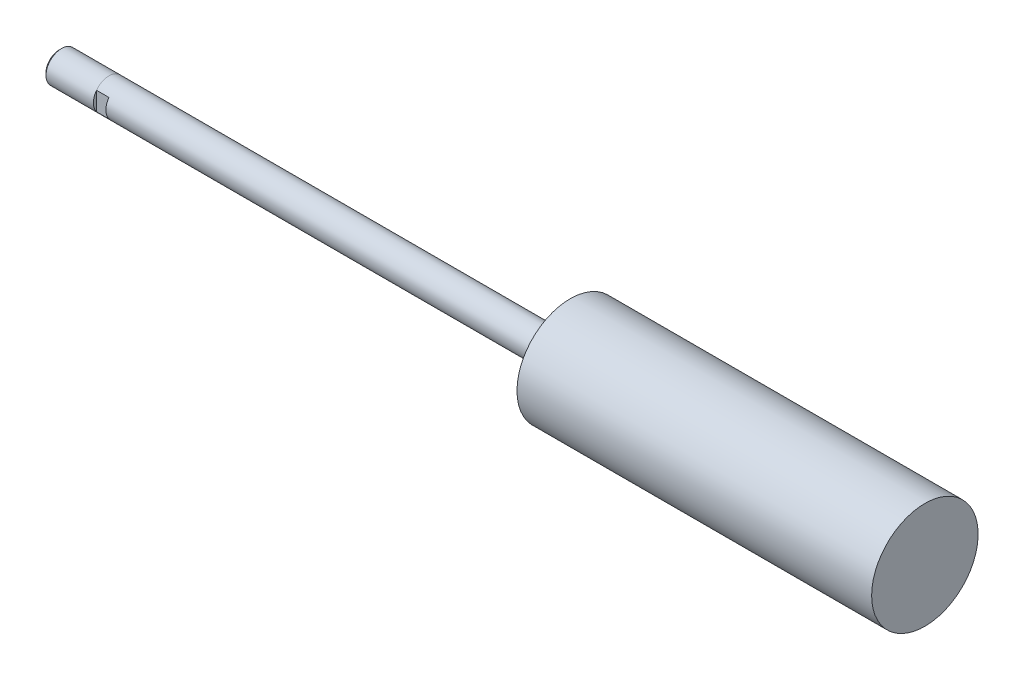
ISO-10303-21;
HEADER;
FILE_DESCRIPTION(('STEP AP214'),'2;1');
FILE_NAME('part.step','',(''),(''),'','','');
FILE_SCHEMA(('AUTOMOTIVE_DESIGN { 1 0 10303 214 1 1 1 1 }'));
ENDSEC;
DATA;
#1=APPLICATION_CONTEXT('core data for automotive mechanical design processes');
#2=APPLICATION_PROTOCOL_DEFINITION('international standard','automotive_design',2000,#1);
#3=PRODUCT_CONTEXT('',#1,'mechanical');
#4=PRODUCT('Part','Part','',(#3));
#5=PRODUCT_RELATED_PRODUCT_CATEGORY('part','',(#4));
#6=PRODUCT_DEFINITION_FORMATION('','',#4);
#7=PRODUCT_DEFINITION_CONTEXT('part definition',#1,'design');
#8=PRODUCT_DEFINITION('design','',#6,#7);
#9=PRODUCT_DEFINITION_SHAPE('','',#8);
#10=(LENGTH_UNIT() NAMED_UNIT(*) SI_UNIT(.MILLI.,.METRE.));
#11=(NAMED_UNIT(*) PLANE_ANGLE_UNIT() SI_UNIT($,.RADIAN.));
#12=(NAMED_UNIT(*) SI_UNIT($,.STERADIAN.) SOLID_ANGLE_UNIT());
#13=UNCERTAINTY_MEASURE_WITH_UNIT(LENGTH_MEASURE(1.E-05),#10,'distance_accuracy_value','');
#14=(GEOMETRIC_REPRESENTATION_CONTEXT(3) GLOBAL_UNCERTAINTY_ASSIGNED_CONTEXT((#13)) GLOBAL_UNIT_ASSIGNED_CONTEXT((#10,
#11,#12)) REPRESENTATION_CONTEXT('',''));
#15=CARTESIAN_POINT('',(0.,0.,0.));
#16=DIRECTION('',(0.,0.,1.));
#17=DIRECTION('',(1.,0.,0.));
#18=AXIS2_PLACEMENT_3D('',#15,#16,#17);
#19=CARTESIAN_POINT('',(204.6224,0.,0.));
#20=DIRECTION('',(-1.,0.,0.));
#21=DIRECTION('',(0.,0.,1.));
#22=AXIS2_PLACEMENT_3D('',#19,#20,#21);
#23=CYLINDRICAL_SURFACE('',#22,3.9624);
#24=DIRECTION('',(-1.,0.,0.));
#25=VECTOR('',#24,1.);
#26=CARTESIAN_POINT('',(204.6224,2.37065154757084,-3.175));
#27=LINE('',#26,#25);
#28=CARTESIAN_POINT('',(0.,2.37065154757084,-3.175));
#29=VERTEX_POINT('',#28);
#30=CARTESIAN_POINT('',(-3.175,2.37595077378542,-3.175));
#31=VERTEX_POINT('',#30);
#32=EDGE_CURVE('E100',#29,#31,#27,.T.);
#33=ORIENTED_EDGE('',*,*,#32,.T.);
#34=CARTESIAN_POINT('',(-3.175,0.,0.));
#35=DIRECTION('',(-1.,0.,0.));
#36=DIRECTION('',(0.,0.599143734238293,0.800641483888384));
#37=AXIS2_PLACEMENT_3D('',#34,#35,#36);
#38=CIRCLE('',#37,3.96875);
#39=CARTESIAN_POINT('',(-3.17500000000001,2.37594941390202,3.17500385247068));
#40=VERTEX_POINT('',#39);
#41=EDGE_CURVE('E80',#40,#31,#38,.T.);
#42=ORIENTED_EDGE('',*,*,#41,.F.);
#43=DIRECTION('',(-1.,0.,0.));
#44=VECTOR('',#43,1.);
#45=CARTESIAN_POINT('',(204.6224,2.37065154757084,3.175));
#46=LINE('',#45,#44);
#47=CARTESIAN_POINT('',(0.,2.37065154757084,3.175));
#48=VERTEX_POINT('',#47);
#49=EDGE_CURVE('E109',#40,#48,#46,.F.);
#50=ORIENTED_EDGE('',*,*,#49,.T.);
#51=CARTESIAN_POINT('',(0.,0.,0.));
#52=DIRECTION('',(1.,0.,0.));
#53=DIRECTION('',(0.,0.,-1.));
#54=AXIS2_PLACEMENT_3D('',#51,#52,#53);
#55=CIRCLE('',#54,3.9624);
#56=CARTESIAN_POINT('',(0.,-2.37065154757084,3.175));
#57=VERTEX_POINT('',#56);
#58=EDGE_CURVE('E11',#48,#57,#55,.T.);
#59=ORIENTED_EDGE('',*,*,#58,.T.);
#60=DIRECTION('',(-1.,0.,0.));
#61=VECTOR('',#60,1.);
#62=CARTESIAN_POINT('',(204.6224,-2.37065154757084,3.175));
#63=LINE('',#62,#61);
#64=CARTESIAN_POINT('',(-3.175,-2.37595077378542,3.175));
#65=VERTEX_POINT('',#64);
#66=EDGE_CURVE('E111',#57,#65,#63,.T.);
#67=ORIENTED_EDGE('',*,*,#66,.T.);
#68=CARTESIAN_POINT('',(-3.175,0.,0.));
#69=DIRECTION('',(-1.,0.,0.));
#70=DIRECTION('',(0.,-0.599143734238397,-0.800641483888306));
#71=AXIS2_PLACEMENT_3D('',#68,#69,#70);
#72=CIRCLE('',#71,3.96875);
#73=CARTESIAN_POINT('',(-3.17500000000001,-2.37594941390243,-3.17500385247037));
#74=VERTEX_POINT('',#73);
#75=EDGE_CURVE('E94',#74,#65,#72,.T.);
#76=ORIENTED_EDGE('',*,*,#75,.F.);
#77=DIRECTION('',(-1.,0.,0.));
#78=VECTOR('',#77,1.);
#79=CARTESIAN_POINT('',(204.6224,-2.37065154757084,-3.175));
#80=LINE('',#79,#78);
#81=CARTESIAN_POINT('',(0.,-2.37065154757084,-3.175));
#82=VERTEX_POINT('',#81);
#83=EDGE_CURVE('E103',#74,#82,#80,.F.);
#84=ORIENTED_EDGE('',*,*,#83,.T.);
#85=EDGE_CURVE('E40',#82,#29,#55,.T.);
#86=ORIENTED_EDGE('',*,*,#85,.T.);
#87=EDGE_LOOP('',(#33,#42,#50,#59,#67,#76,#84,#86));
#88=FACE_BOUND('',#87,.T.);
#89=CARTESIAN_POINT('',(114.3,0.,0.));
#90=DIRECTION('',(-1.,0.,0.));
#91=DIRECTION('',(0.,0.,1.));
#92=AXIS2_PLACEMENT_3D('',#89,#90,#91);
#93=CIRCLE('',#92,3.9624);
#94=CARTESIAN_POINT('',(114.3,0.,3.9624));
#95=VERTEX_POINT('',#94);
#96=EDGE_CURVE('E199',#95,#95,#93,.T.);
#97=ORIENTED_EDGE('',*,*,#96,.T.);
#98=EDGE_LOOP('',(#97));
#99=FACE_BOUND('',#98,.T.);
#100=ADVANCED_FACE('F36',(#88,#99),#23,.T.);
#101=CARTESIAN_POINT('',(114.3,3.9624,0.));
#102=DIRECTION('',(1.,0.,0.));
#103=DIRECTION('',(0.,0.,-1.));
#104=AXIS2_PLACEMENT_3D('',#101,#102,#103);
#105=PLANE('',#104);
#106=ORIENTED_EDGE('',*,*,#96,.F.);
#107=EDGE_LOOP('',(#106));
#108=FACE_BOUND('',#107,.T.);
#109=CARTESIAN_POINT('',(114.3,0.,0.));
#110=DIRECTION('',(-1.,0.,0.));
#111=DIRECTION('',(0.,0.,1.));
#112=AXIS2_PLACEMENT_3D('',#109,#110,#111);
#113=CIRCLE('',#112,13.55725);
#114=CARTESIAN_POINT('',(114.3,0.,13.55725));
#115=VERTEX_POINT('',#114);
#116=EDGE_CURVE('E201',#115,#115,#113,.T.);
#117=ORIENTED_EDGE('',*,*,#116,.T.);
#118=EDGE_LOOP('',(#117));
#119=FACE_BOUND('',#118,.T.);
#120=ADVANCED_FACE('F219',(#108,#119),#105,.F.);
#121=CARTESIAN_POINT('',(204.6224,0.,0.));
#122=DIRECTION('',(-1.,0.,0.));
#123=DIRECTION('',(0.,0.,1.));
#124=AXIS2_PLACEMENT_3D('',#121,#122,#123);
#125=CYLINDRICAL_SURFACE('',#124,13.55725);
#126=ORIENTED_EDGE('',*,*,#116,.F.);
#127=EDGE_LOOP('',(#126));
#128=FACE_BOUND('',#127,.T.);
#129=CARTESIAN_POINT('',(204.6224,0.,0.));
#130=DIRECTION('',(-1.,0.,0.));
#131=DIRECTION('',(0.,0.,1.));
#132=AXIS2_PLACEMENT_3D('',#129,#130,#131);
#133=CIRCLE('',#132,13.55725);
#134=CARTESIAN_POINT('',(204.6224,0.,13.55725));
#135=VERTEX_POINT('',#134);
#136=EDGE_CURVE('E144',#135,#135,#133,.T.);
#137=ORIENTED_EDGE('',*,*,#136,.T.);
#138=EDGE_LOOP('',(#137));
#139=FACE_BOUND('',#138,.T.);
#140=ADVANCED_FACE('F208',(#128,#139),#125,.T.);
#141=CARTESIAN_POINT('',(204.6224,13.55725,0.));
#142=DIRECTION('',(-1.,0.,0.));
#143=DIRECTION('',(0.,0.,1.));
#144=AXIS2_PLACEMENT_3D('',#141,#142,#143);
#145=PLANE('',#144);
#146=ORIENTED_EDGE('',*,*,#136,.F.);
#147=EDGE_LOOP('',(#146));
#148=FACE_BOUND('',#147,.T.);
#149=ADVANCED_FACE('F210',(#148),#145,.F.);
#150=CARTESIAN_POINT('',(-15.875,0.,0.));
#151=DIRECTION('',(1.,0.,0.));
#152=DIRECTION('',(0.,0.,-1.));
#153=AXIS2_PLACEMENT_3D('',#150,#151,#152);
#154=PLANE('',#153);
#155=CARTESIAN_POINT('',(-15.875,0.,0.));
#156=DIRECTION('',(-1.,0.,0.));
#157=DIRECTION('',(0.,0.,1.));
#158=AXIS2_PLACEMENT_3D('',#155,#156,#157);
#159=CIRCLE('',#158,3.33883);
#160=CARTESIAN_POINT('',(-15.875,0.,3.33883));
#161=VERTEX_POINT('',#160);
#162=EDGE_CURVE('E137',#161,#161,#159,.T.);
#163=ORIENTED_EDGE('',*,*,#162,.T.);
#164=EDGE_LOOP('',(#163));
#165=FACE_BOUND('',#164,.T.);
#166=ADVANCED_FACE('F212',(#165),#154,.F.);
#167=CARTESIAN_POINT('',(-15.24508,0.,0.));
#168=DIRECTION('',(1.,0.,0.));
#169=DIRECTION('',(0.,0.,-1.));
#170=AXIS2_PLACEMENT_3D('',#167,#168,#169);
#171=CONICAL_SURFACE('',#170,3.96875,0.785398163397449);
#172=ORIENTED_EDGE('',*,*,#162,.F.);
#173=EDGE_LOOP('',(#172));
#174=FACE_BOUND('',#173,.T.);
#175=CARTESIAN_POINT('',(-15.24508,0.,0.));
#176=DIRECTION('',(-1.,0.,0.));
#177=DIRECTION('',(0.,0.,1.));
#178=AXIS2_PLACEMENT_3D('',#175,#176,#177);
#179=CIRCLE('',#178,3.96875);
#180=CARTESIAN_POINT('',(-15.24508,0.,3.96875));
#181=VERTEX_POINT('',#180);
#182=EDGE_CURVE('E134',#181,#181,#179,.T.);
#183=ORIENTED_EDGE('',*,*,#182,.T.);
#184=EDGE_LOOP('',(#183));
#185=FACE_BOUND('',#184,.T.);
#186=ADVANCED_FACE('F172',(#174,#185),#171,.T.);
#187=CARTESIAN_POINT('',(-3.175,0.,0.));
#188=DIRECTION('',(-1.,0.,0.));
#189=DIRECTION('',(0.,0.,1.));
#190=AXIS2_PLACEMENT_3D('',#187,#188,#189);
#191=CYLINDRICAL_SURFACE('',#190,3.96875);
#192=ORIENTED_EDGE('',*,*,#182,.F.);
#193=EDGE_LOOP('',(#192));
#194=FACE_BOUND('',#193,.T.);
#195=ORIENTED_EDGE('',*,*,#41,.T.);
#196=CARTESIAN_POINT('',(-3.175,0.,0.));
#197=DIRECTION('',(-1.,0.,0.));
#198=DIRECTION('',(0.,0.599143734238395,-0.800641483888308));
#199=AXIS2_PLACEMENT_3D('',#196,#197,#198);
#200=CIRCLE('',#199,3.96875);
#201=EDGE_CURVE('E83',#31,#74,#200,.T.);
#202=ORIENTED_EDGE('',*,*,#201,.T.);
#203=ORIENTED_EDGE('',*,*,#75,.T.);
#204=CARTESIAN_POINT('',(-3.175,0.,0.));
#205=DIRECTION('',(-1.,0.,0.));
#206=DIRECTION('',(0.,-0.599143734238393,0.800641483888309));
#207=AXIS2_PLACEMENT_3D('',#204,#205,#206);
#208=CIRCLE('',#207,3.96875);
#209=EDGE_CURVE('E85',#65,#40,#208,.T.);
#210=ORIENTED_EDGE('',*,*,#209,.T.);
#211=EDGE_LOOP('',(#195,#202,#203,#210));
#212=FACE_BOUND('',#211,.T.);
#213=ADVANCED_FACE('F82',(#194,#212),#191,.T.);
#214=CARTESIAN_POINT('',(-3.175,0.,0.));
#215=DIRECTION('',(1.,0.,0.));
#216=DIRECTION('',(0.,0.,-1.));
#217=AXIS2_PLACEMENT_3D('',#214,#215,#216);
#218=PLANE('',#217);
#219=ORIENTED_EDGE('',*,*,#201,.F.);
#220=DIRECTION('',(0.,1.,0.));
#221=VECTOR('',#220,1.);
#222=CARTESIAN_POINT('',(-3.175,-3.9624,-3.175));
#223=LINE('',#222,#221);
#224=EDGE_CURVE('E50',#74,#31,#223,.T.);
#225=ORIENTED_EDGE('',*,*,#224,.F.);
#226=EDGE_LOOP('',(#219,#225));
#227=FACE_BOUND('',#226,.T.);
#228=ADVANCED_FACE('F93',(#227),#218,.T.);
#229=CARTESIAN_POINT('',(0.,-3.9624,-3.175));
#230=DIRECTION('',(0.,0.,1.));
#231=DIRECTION('',(1.,0.,0.));
#232=AXIS2_PLACEMENT_3D('',#229,#230,#231);
#233=PLANE('',#232);
#234=DIRECTION('',(0.,1.,0.));
#235=VECTOR('',#234,1.);
#236=CARTESIAN_POINT('',(0.,-3.9624,-3.175));
#237=LINE('',#236,#235);
#238=EDGE_CURVE('E113',#82,#29,#237,.T.);
#239=ORIENTED_EDGE('',*,*,#238,.F.);
#240=ORIENTED_EDGE('',*,*,#83,.F.);
#241=ORIENTED_EDGE('',*,*,#224,.T.);
#242=ORIENTED_EDGE('',*,*,#32,.F.);
#243=EDGE_LOOP('',(#239,#240,#241,#242));
#244=FACE_BOUND('',#243,.T.);
#245=ADVANCED_FACE('F99',(#244),#233,.F.);
#246=CARTESIAN_POINT('',(0.,0.,0.));
#247=DIRECTION('',(1.,0.,0.));
#248=DIRECTION('',(0.,0.,-1.));
#249=AXIS2_PLACEMENT_3D('',#246,#247,#248);
#250=PLANE('',#249);
#251=ORIENTED_EDGE('',*,*,#238,.T.);
#252=ORIENTED_EDGE('',*,*,#85,.F.);
#253=EDGE_LOOP('',(#251,#252));
#254=FACE_BOUND('',#253,.T.);
#255=ADVANCED_FACE('F260',(#254),#250,.F.);
#256=DIRECTION('',(0.,-1.,0.));
#257=VECTOR('',#256,1.);
#258=CARTESIAN_POINT('',(0.,3.9624,3.175));
#259=LINE('',#258,#257);
#260=EDGE_CURVE('E105',#48,#57,#259,.T.);
#261=ORIENTED_EDGE('',*,*,#260,.T.);
#262=ORIENTED_EDGE('',*,*,#58,.F.);
#263=EDGE_LOOP('',(#261,#262));
#264=FACE_BOUND('',#263,.T.);
#265=ADVANCED_FACE('F130',(#264),#250,.F.);
#266=ORIENTED_EDGE('',*,*,#209,.F.);
#267=DIRECTION('',(0.,-1.,0.));
#268=VECTOR('',#267,1.);
#269=CARTESIAN_POINT('',(-3.175,3.9624,3.175));
#270=LINE('',#269,#268);
#271=EDGE_CURVE('E57',#40,#65,#270,.T.);
#272=ORIENTED_EDGE('',*,*,#271,.F.);
#273=EDGE_LOOP('',(#266,#272));
#274=FACE_BOUND('',#273,.T.);
#275=ADVANCED_FACE('F150',(#274),#218,.T.);
#276=CARTESIAN_POINT('',(0.,3.9624,3.175));
#277=DIRECTION('',(0.,0.,-1.));
#278=DIRECTION('',(-1.,0.,0.));
#279=AXIS2_PLACEMENT_3D('',#276,#277,#278);
#280=PLANE('',#279);
#281=ORIENTED_EDGE('',*,*,#260,.F.);
#282=ORIENTED_EDGE('',*,*,#49,.F.);
#283=ORIENTED_EDGE('',*,*,#271,.T.);
#284=ORIENTED_EDGE('',*,*,#66,.F.);
#285=EDGE_LOOP('',(#281,#282,#283,#284));
#286=FACE_BOUND('',#285,.T.);
#287=ADVANCED_FACE('F133',(#286),#280,.F.);
#288=CLOSED_SHELL('',(#100,#120,#140,#149,#166,#186,#213,#228,#245,#255,#265,#275,#287));
#289=MANIFOLD_SOLID_BREP('B2',#288);
#290=ADVANCED_BREP_SHAPE_REPRESENTATION('',(#18,#289),#14);
#291=SHAPE_DEFINITION_REPRESENTATION(#9,#290);
ENDSEC;
END-ISO-10303-21;
